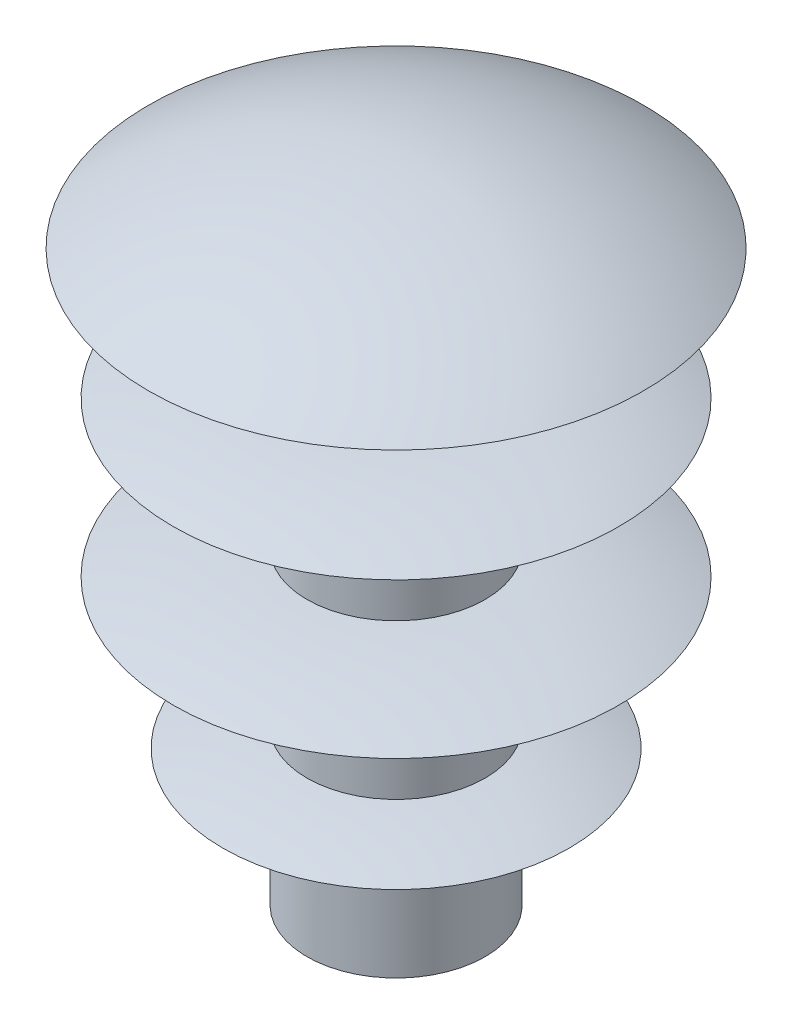
ISO-10303-21;
HEADER;
FILE_DESCRIPTION(('STEP AP214'),'2;1');
FILE_NAME('part.step','',(''),(''),'','','');
FILE_SCHEMA(('AUTOMOTIVE_DESIGN { 1 0 10303 214 1 1 1 1 }'));
ENDSEC;
DATA;
#1=APPLICATION_CONTEXT('core data for automotive mechanical design processes');
#2=APPLICATION_PROTOCOL_DEFINITION('international standard','automotive_design',2000,#1);
#3=PRODUCT_CONTEXT('',#1,'mechanical');
#4=PRODUCT('Part','Part','',(#3));
#5=PRODUCT_RELATED_PRODUCT_CATEGORY('part','',(#4));
#6=PRODUCT_DEFINITION_FORMATION('','',#4);
#7=PRODUCT_DEFINITION_CONTEXT('part definition',#1,'design');
#8=PRODUCT_DEFINITION('design','',#6,#7);
#9=PRODUCT_DEFINITION_SHAPE('','',#8);
#10=(LENGTH_UNIT() NAMED_UNIT(*) SI_UNIT(.MILLI.,.METRE.));
#11=(NAMED_UNIT(*) PLANE_ANGLE_UNIT() SI_UNIT($,.RADIAN.));
#12=(NAMED_UNIT(*) SI_UNIT($,.STERADIAN.) SOLID_ANGLE_UNIT());
#13=UNCERTAINTY_MEASURE_WITH_UNIT(LENGTH_MEASURE(1.E-05),#10,'distance_accuracy_value','');
#14=(GEOMETRIC_REPRESENTATION_CONTEXT(3) GLOBAL_UNCERTAINTY_ASSIGNED_CONTEXT((#13)) GLOBAL_UNIT_ASSIGNED_CONTEXT((#10,
#11,#12)) REPRESENTATION_CONTEXT('',''));
#15=CARTESIAN_POINT('',(0.,0.,0.));
#16=DIRECTION('',(0.,0.,1.));
#17=DIRECTION('',(1.,0.,0.));
#18=AXIS2_PLACEMENT_3D('',#15,#16,#17);
#19=CARTESIAN_POINT('',(0.900000000000001,-13.,0.));
#20=DIRECTION('',(0.,-1.,0.));
#21=DIRECTION('',(0.,0.,-1.));
#22=AXIS2_PLACEMENT_3D('',#19,#20,#21);
#23=PLANE('',#22);
#24=CARTESIAN_POINT('',(0.,-13.,0.));
#25=DIRECTION('',(0.,-1.,0.));
#26=DIRECTION('',(1.,0.,0.));
#27=AXIS2_PLACEMENT_3D('',#24,#25,#26);
#28=CIRCLE('',#27,1.8);
#29=CARTESIAN_POINT('',(1.8,-13.,0.));
#30=VERTEX_POINT('',#29);
#31=EDGE_CURVE('E20',#30,#30,#28,.F.);
#32=ORIENTED_EDGE('',*,*,#31,.F.);
#33=EDGE_LOOP('',(#32));
#34=FACE_BOUND('',#33,.T.);
#35=ADVANCED_FACE('F16',(#34),#23,.T.);
#36=CARTESIAN_POINT('',(0.,-11.8125,0.));
#37=DIRECTION('',(0.,-1.,0.));
#38=DIRECTION('',(1.,0.,0.));
#39=AXIS2_PLACEMENT_3D('',#36,#37,#38);
#40=CYLINDRICAL_SURFACE('',#39,1.8);
#41=CARTESIAN_POINT('',(0.,-10.625,0.));
#42=DIRECTION('',(0.,1.,0.));
#43=DIRECTION('',(-1.,0.,0.));
#44=AXIS2_PLACEMENT_3D('',#41,#42,#43);
#45=CIRCLE('',#44,1.8);
#46=CARTESIAN_POINT('',(-1.8,-10.625,0.));
#47=VERTEX_POINT('',#46);
#48=EDGE_CURVE('E126',#47,#47,#45,.T.);
#49=ORIENTED_EDGE('',*,*,#48,.F.);
#50=EDGE_LOOP('',(#49));
#51=FACE_BOUND('',#50,.T.);
#52=ORIENTED_EDGE('',*,*,#31,.T.);
#53=EDGE_LOOP('',(#52));
#54=FACE_BOUND('',#53,.T.);
#55=ADVANCED_FACE('F58',(#51,#54),#40,.T.);
#56=CARTESIAN_POINT('',(0.,-2.15127178607086,0.));
#57=DIRECTION('',(0.,1.,0.));
#58=DIRECTION('',(0.,0.,1.));
#59=AXIS2_PLACEMENT_3D('',#56,#57,#58);
#60=DEGENERATE_TOROIDAL_SURFACE('',#59,0.822155541045052,8.52996187737365,.T.);
#61=CARTESIAN_POINT('',(0.,-10.25,0.));
#62=DIRECTION('',(0.,1.,0.));
#63=DIRECTION('',(0.,0.,1.));
#64=AXIS2_PLACEMENT_3D('',#61,#62,#63);
#65=CIRCLE('',#64,3.5);
#66=CARTESIAN_POINT('',(0.,-10.25,3.5));
#67=VERTEX_POINT('',#66);
#68=EDGE_CURVE('E121',#67,#67,#65,.T.);
#69=ORIENTED_EDGE('',*,*,#68,.F.);
#70=EDGE_LOOP('',(#69));
#71=FACE_BOUND('',#70,.T.);
#72=ORIENTED_EDGE('',*,*,#48,.T.);
#73=EDGE_LOOP('',(#72));
#74=FACE_BOUND('',#73,.T.);
#75=ADVANCED_FACE('F61',(#71,#74),#60,.T.);
#76=CARTESIAN_POINT('',(0.,-18.0410373966159,0.));
#77=DIRECTION('',(0.,1.,0.));
#78=DIRECTION('',(0.,0.,1.));
#79=AXIS2_PLACEMENT_3D('',#76,#77,#78);
#80=DEGENERATE_TOROIDAL_SURFACE('',#79,0.890028515452369,8.21658170199867,.T.);
#81=CARTESIAN_POINT('',(0.,-9.875,0.));
#82=DIRECTION('',(0.,-1.,0.));
#83=DIRECTION('',(1.,0.,0.));
#84=AXIS2_PLACEMENT_3D('',#81,#82,#83);
#85=CIRCLE('',#84,1.8);
#86=CARTESIAN_POINT('',(1.8,-9.875,0.));
#87=VERTEX_POINT('',#86);
#88=EDGE_CURVE('E116',#87,#87,#85,.F.);
#89=ORIENTED_EDGE('',*,*,#88,.F.);
#90=EDGE_LOOP('',(#89));
#91=FACE_BOUND('',#90,.T.);
#92=ORIENTED_EDGE('',*,*,#68,.T.);
#93=EDGE_LOOP('',(#92));
#94=FACE_BOUND('',#93,.T.);
#95=ADVANCED_FACE('F56',(#91,#94),#80,.T.);
#96=CARTESIAN_POINT('',(0.,-8.8125,0.));
#97=DIRECTION('',(0.,-1.,0.));
#98=DIRECTION('',(1.,0.,0.));
#99=AXIS2_PLACEMENT_3D('',#96,#97,#98);
#100=CYLINDRICAL_SURFACE('',#99,1.8);
#101=CARTESIAN_POINT('',(0.,-7.75,0.));
#102=DIRECTION('',(0.,1.,0.));
#103=DIRECTION('',(-1.,0.,0.));
#104=AXIS2_PLACEMENT_3D('',#101,#102,#103);
#105=CIRCLE('',#104,1.8);
#106=CARTESIAN_POINT('',(-1.8,-7.75000000000001,0.));
#107=VERTEX_POINT('',#106);
#108=EDGE_CURVE('E111',#107,#107,#105,.T.);
#109=ORIENTED_EDGE('',*,*,#108,.F.);
#110=EDGE_LOOP('',(#109));
#111=FACE_BOUND('',#110,.T.);
#112=ORIENTED_EDGE('',*,*,#88,.T.);
#113=EDGE_LOOP('',(#112));
#114=FACE_BOUND('',#113,.T.);
#115=ADVANCED_FACE('F52',(#111,#114),#100,.T.);
#116=CARTESIAN_POINT('',(0.,0.465629052558852,0.));
#117=DIRECTION('',(0.,1.,0.));
#118=DIRECTION('',(-1.,0.,0.));
#119=AXIS2_PLACEMENT_3D('',#116,#117,#118);
#120=DEGENERATE_TOROIDAL_SURFACE('',#119,1.6748835087854,8.21658170199889,.T.);
#121=CARTESIAN_POINT('',(0.,-7.25,0.));
#122=DIRECTION('',(0.,1.,0.));
#123=DIRECTION('',(0.,0.,1.));
#124=AXIS2_PLACEMENT_3D('',#121,#122,#123);
#125=CIRCLE('',#124,4.5);
#126=CARTESIAN_POINT('',(0.,-7.25,4.5));
#127=VERTEX_POINT('',#126);
#128=EDGE_CURVE('E106',#127,#127,#125,.T.);
#129=ORIENTED_EDGE('',*,*,#128,.F.);
#130=EDGE_LOOP('',(#129));
#131=FACE_BOUND('',#130,.T.);
#132=ORIENTED_EDGE('',*,*,#108,.T.);
#133=EDGE_LOOP('',(#132));
#134=FACE_BOUND('',#133,.T.);
#135=ADVANCED_FACE('F55',(#131,#134),#120,.T.);
#136=CARTESIAN_POINT('',(0.,-15.8551495032871,0.));
#137=DIRECTION('',(0.,1.,0.));
#138=DIRECTION('',(0.,0.,1.));
#139=AXIS2_PLACEMENT_3D('',#136,#137,#138);
#140=DEGENERATE_TOROIDAL_SURFACE('',#139,1.5101574993913,9.10976158592353,.T.);
#141=CARTESIAN_POINT('',(0.,-6.75,0.));
#142=DIRECTION('',(0.,-1.,0.));
#143=DIRECTION('',(1.,0.,0.));
#144=AXIS2_PLACEMENT_3D('',#141,#142,#143);
#145=CIRCLE('',#144,1.8);
#146=CARTESIAN_POINT('',(1.8,-6.75,0.));
#147=VERTEX_POINT('',#146);
#148=EDGE_CURVE('E95',#147,#147,#145,.F.);
#149=ORIENTED_EDGE('',*,*,#148,.F.);
#150=EDGE_LOOP('',(#149));
#151=FACE_BOUND('',#150,.T.);
#152=ORIENTED_EDGE('',*,*,#128,.T.);
#153=EDGE_LOOP('',(#152));
#154=FACE_BOUND('',#153,.T.);
#155=ADVANCED_FACE('F50',(#151,#154),#140,.T.);
#156=CARTESIAN_POINT('',(0.,-5.6875,0.));
#157=DIRECTION('',(0.,-1.,0.));
#158=DIRECTION('',(1.,0.,0.));
#159=AXIS2_PLACEMENT_3D('',#156,#157,#158);
#160=CYLINDRICAL_SURFACE('',#159,1.8);
#161=CARTESIAN_POINT('',(0.,-4.625,0.));
#162=DIRECTION('',(0.,1.,0.));
#163=DIRECTION('',(0.,0.,1.));
#164=AXIS2_PLACEMENT_3D('',#161,#162,#163);
#165=CIRCLE('',#164,1.8);
#166=CARTESIAN_POINT('',(0.,-4.625,1.8));
#167=VERTEX_POINT('',#166);
#168=EDGE_CURVE('E91',#167,#167,#165,.T.);
#169=ORIENTED_EDGE('',*,*,#168,.F.);
#170=EDGE_LOOP('',(#169));
#171=FACE_BOUND('',#170,.T.);
#172=ORIENTED_EDGE('',*,*,#148,.T.);
#173=EDGE_LOOP('',(#172));
#174=FACE_BOUND('',#173,.T.);
#175=ADVANCED_FACE('F46',(#171,#174),#160,.T.);
#176=CARTESIAN_POINT('',(0.,4.48014950328707,0.));
#177=DIRECTION('',(0.,1.,0.));
#178=DIRECTION('',(0.,0.,1.));
#179=AXIS2_PLACEMENT_3D('',#176,#177,#178);
#180=DEGENERATE_TOROIDAL_SURFACE('',#179,1.51015749939129,9.10976158592353,.T.);
#181=CARTESIAN_POINT('',(0.,-4.125,0.));
#182=DIRECTION('',(0.,1.,0.));
#183=DIRECTION('',(0.,0.,1.));
#184=AXIS2_PLACEMENT_3D('',#181,#182,#183);
#185=CIRCLE('',#184,4.50000000000001);
#186=CARTESIAN_POINT('',(0.,-4.125,4.50000000000001));
#187=VERTEX_POINT('',#186);
#188=EDGE_CURVE('E90',#187,#187,#185,.T.);
#189=ORIENTED_EDGE('',*,*,#188,.F.);
#190=EDGE_LOOP('',(#189));
#191=FACE_BOUND('',#190,.T.);
#192=ORIENTED_EDGE('',*,*,#168,.T.);
#193=EDGE_LOOP('',(#192));
#194=FACE_BOUND('',#193,.T.);
#195=ADVANCED_FACE('F49',(#191,#194),#180,.T.);
#196=CARTESIAN_POINT('',(0.,-11.8406290525589,0.));
#197=DIRECTION('',(0.,1.,0.));
#198=DIRECTION('',(0.,0.,1.));
#199=AXIS2_PLACEMENT_3D('',#196,#197,#198);
#200=DEGENERATE_TOROIDAL_SURFACE('',#199,1.67488350878539,8.21658170199889,.T.);
#201=CARTESIAN_POINT('',(0.,-3.625,0.));
#202=DIRECTION('',(0.,-1.,0.));
#203=DIRECTION('',(1.,0.,0.));
#204=AXIS2_PLACEMENT_3D('',#201,#202,#203);
#205=CIRCLE('',#204,1.8);
#206=CARTESIAN_POINT('',(1.8,-3.625,0.));
#207=VERTEX_POINT('',#206);
#208=EDGE_CURVE('E87',#207,#207,#205,.F.);
#209=ORIENTED_EDGE('',*,*,#208,.F.);
#210=EDGE_LOOP('',(#209));
#211=FACE_BOUND('',#210,.T.);
#212=ORIENTED_EDGE('',*,*,#188,.T.);
#213=EDGE_LOOP('',(#212));
#214=FACE_BOUND('',#213,.T.);
#215=ADVANCED_FACE('F41',(#211,#214),#200,.T.);
#216=CARTESIAN_POINT('',(0.,-2.5625,0.));
#217=DIRECTION('',(0.,-1.,0.));
#218=DIRECTION('',(1.,0.,0.));
#219=AXIS2_PLACEMENT_3D('',#216,#217,#218);
#220=CYLINDRICAL_SURFACE('',#219,1.8);
#221=CARTESIAN_POINT('',(0.,-1.5,0.));
#222=DIRECTION('',(0.,-1.,0.));
#223=DIRECTION('',(1.,0.,0.));
#224=AXIS2_PLACEMENT_3D('',#221,#222,#223);
#225=CIRCLE('',#224,1.8);
#226=CARTESIAN_POINT('',(1.8,-1.5,0.));
#227=VERTEX_POINT('',#226);
#228=EDGE_CURVE('E24',#227,#227,#225,.F.);
#229=ORIENTED_EDGE('',*,*,#228,.F.);
#230=EDGE_LOOP('',(#229));
#231=FACE_BOUND('',#230,.T.);
#232=ORIENTED_EDGE('',*,*,#208,.T.);
#233=EDGE_LOOP('',(#232));
#234=FACE_BOUND('',#233,.T.);
#235=ADVANCED_FACE('F34',(#231,#234),#220,.T.);
#236=CARTESIAN_POINT('',(3.4,-1.5,0.));
#237=DIRECTION('',(0.,-1.,0.));
#238=DIRECTION('',(0.,0.,-1.));
#239=AXIS2_PLACEMENT_3D('',#236,#237,#238);
#240=PLANE('',#239);
#241=ORIENTED_EDGE('',*,*,#228,.T.);
#242=EDGE_LOOP('',(#241));
#243=FACE_BOUND('',#242,.T.);
#244=CARTESIAN_POINT('',(0.,-1.50000000000008,1.80953342587831E-13));
#245=DIRECTION('',(0.,1.,0.));
#246=DIRECTION('',(0.,0.,1.));
#247=AXIS2_PLACEMENT_3D('',#244,#245,#246);
#248=CIRCLE('',#247,4.99999999999995);
#249=CARTESIAN_POINT('',(0.,-1.50000000000008,5.00000000000013));
#250=VERTEX_POINT('',#249);
#251=EDGE_CURVE('E10',#250,#250,#248,.T.);
#252=ORIENTED_EDGE('',*,*,#251,.F.);
#253=EDGE_LOOP('',(#252));
#254=FACE_BOUND('',#253,.T.);
#255=ADVANCED_FACE('F30',(#243,#254),#240,.T.);
#256=CARTESIAN_POINT('',(0.,-9.35780634945411,-0.0823419048362367));
#257=DIRECTION('',(-1.,0.,0.));
#258=DIRECTION('',(0.,0.,1.));
#259=AXIS2_PLACEMENT_3D('',#256,#257,#258);
#260=CIRCLE('',#259,9.35816861694508);
#261=TRIMMED_CURVE('',#260,(PARAMETER_VALUE(-1.5619972795939)),
(PARAMETER_VALUE(1.5619972795939)),.T.,.PARAMETER.);
#262=CARTESIAN_POINT('',(0.,-9.35780634945411,1.80953342587831E-13));
#263=DIRECTION('',(0.,1.,0.));
#264=AXIS1_PLACEMENT('',#262,#263);
#265=SURFACE_OF_REVOLUTION('',#261,#264);
#266=CARTESIAN_POINT('',(0.,0.,1.809525E-13));
#267=VERTEX_POINT('',#266);
#268=VERTEX_LOOP('',#267);
#269=FACE_BOUND('',#268,.T.);
#270=ORIENTED_EDGE('',*,*,#251,.T.);
#271=EDGE_LOOP('',(#270));
#272=FACE_BOUND('',#271,.T.);
#273=ADVANCED_FACE('F18',(#269,#272),#265,.T.);
#274=CLOSED_SHELL('',(#35,#55,#75,#95,#115,#135,#155,#175,#195,#215,#235,#255,#273));
#275=MANIFOLD_SOLID_BREP('B1',#274);
#276=ADVANCED_BREP_SHAPE_REPRESENTATION('',(#18,#275),#14);
#277=SHAPE_DEFINITION_REPRESENTATION(#9,#276);
ENDSEC;
END-ISO-10303-21;
